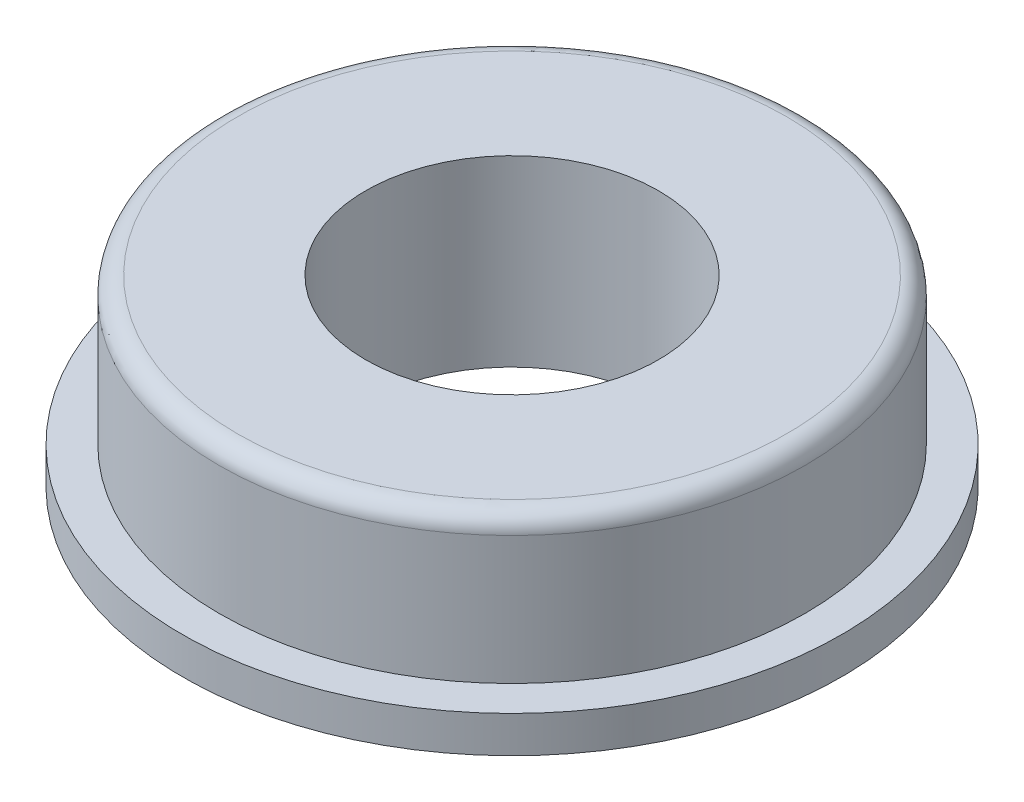
ISO-10303-21;
HEADER;
FILE_DESCRIPTION(('STEP AP214'),'2;1');
FILE_NAME('part.step','',(''),(''),'','','');
FILE_SCHEMA(('AUTOMOTIVE_DESIGN { 1 0 10303 214 1 1 1 1 }'));
ENDSEC;
DATA;
#1=APPLICATION_CONTEXT('core data for automotive mechanical design processes');
#2=APPLICATION_PROTOCOL_DEFINITION('international standard','automotive_design',2000,#1);
#3=PRODUCT_CONTEXT('',#1,'mechanical');
#4=PRODUCT('Part','Part','',(#3));
#5=PRODUCT_RELATED_PRODUCT_CATEGORY('part','',(#4));
#6=PRODUCT_DEFINITION_FORMATION('','',#4);
#7=PRODUCT_DEFINITION_CONTEXT('part definition',#1,'design');
#8=PRODUCT_DEFINITION('design','',#6,#7);
#9=PRODUCT_DEFINITION_SHAPE('','',#8);
#10=(LENGTH_UNIT() NAMED_UNIT(*) SI_UNIT(.MILLI.,.METRE.));
#11=(NAMED_UNIT(*) PLANE_ANGLE_UNIT() SI_UNIT($,.RADIAN.));
#12=(NAMED_UNIT(*) SI_UNIT($,.STERADIAN.) SOLID_ANGLE_UNIT());
#13=UNCERTAINTY_MEASURE_WITH_UNIT(LENGTH_MEASURE(1.E-05),#10,'distance_accuracy_value','');
#14=(GEOMETRIC_REPRESENTATION_CONTEXT(3) GLOBAL_UNCERTAINTY_ASSIGNED_CONTEXT((#13)) GLOBAL_UNIT_ASSIGNED_CONTEXT((#10,
#11,#12)) REPRESENTATION_CONTEXT('',''));
#15=CARTESIAN_POINT('',(0.,0.,0.));
#16=DIRECTION('',(0.,0.,1.));
#17=DIRECTION('',(1.,0.,0.));
#18=AXIS2_PLACEMENT_3D('',#15,#16,#17);
#19=CARTESIAN_POINT('',(0.,4.5,0.));
#20=DIRECTION('',(0.,1.,0.));
#21=DIRECTION('',(0.,0.,1.));
#22=AXIS2_PLACEMENT_3D('',#19,#20,#21);
#23=TOROIDAL_SURFACE('',#22,7.5,0.5);
#24=CARTESIAN_POINT('',(0.,4.5,0.));
#25=DIRECTION('',(0.,-1.,0.));
#26=DIRECTION('',(0.,0.,-1.));
#27=AXIS2_PLACEMENT_3D('',#24,#25,#26);
#28=CIRCLE('',#27,8.);
#29=CARTESIAN_POINT('',(0.,4.5,-8.));
#30=VERTEX_POINT('',#29);
#31=EDGE_CURVE('E46',#30,#30,#28,.T.);
#32=ORIENTED_EDGE('',*,*,#31,.F.);
#33=EDGE_LOOP('',(#32));
#34=FACE_BOUND('',#33,.T.);
#35=CARTESIAN_POINT('',(0.,5.,0.));
#36=DIRECTION('',(0.,-1.,0.));
#37=DIRECTION('',(0.,0.,1.));
#38=AXIS2_PLACEMENT_3D('',#35,#36,#37);
#39=CIRCLE('',#38,7.5);
#40=CARTESIAN_POINT('',(0.,5.,-7.5));
#41=VERTEX_POINT('',#40);
#42=CARTESIAN_POINT('',(0.,5.,7.5));
#43=VERTEX_POINT('',#42);
#44=EDGE_CURVE('E38',#41,#43,#39,.F.);
#45=ORIENTED_EDGE('',*,*,#44,.F.);
#46=CARTESIAN_POINT('',(0.,5.,0.));
#47=DIRECTION('',(0.,-1.,0.));
#48=DIRECTION('',(0.,0.,-1.));
#49=AXIS2_PLACEMENT_3D('',#46,#47,#48);
#50=CIRCLE('',#49,7.5);
#51=EDGE_CURVE('E35',#43,#41,#50,.F.);
#52=ORIENTED_EDGE('',*,*,#51,.F.);
#53=EDGE_LOOP('',(#45,#52));
#54=FACE_BOUND('',#53,.T.);
#55=ADVANCED_FACE('F17',(#34,#54),#23,.T.);
#56=CARTESIAN_POINT('',(0.,5.,0.));
#57=DIRECTION('',(0.,-1.,0.));
#58=DIRECTION('',(0.,0.,-1.));
#59=AXIS2_PLACEMENT_3D('',#56,#57,#58);
#60=CYLINDRICAL_SURFACE('',#59,8.);
#61=CARTESIAN_POINT('',(0.,1.,0.));
#62=DIRECTION('',(0.,-1.,0.));
#63=DIRECTION('',(0.,0.,-1.));
#64=AXIS2_PLACEMENT_3D('',#61,#62,#63);
#65=CIRCLE('',#64,8.);
#66=CARTESIAN_POINT('',(0.,1.,-8.));
#67=VERTEX_POINT('',#66);
#68=EDGE_CURVE('E43',#67,#67,#65,.F.);
#69=ORIENTED_EDGE('',*,*,#68,.T.);
#70=EDGE_LOOP('',(#69));
#71=FACE_BOUND('',#70,.T.);
#72=ORIENTED_EDGE('',*,*,#31,.T.);
#73=EDGE_LOOP('',(#72));
#74=FACE_BOUND('',#73,.T.);
#75=ADVANCED_FACE('F80',(#71,#74),#60,.T.);
#76=CARTESIAN_POINT('',(0.,5.,0.));
#77=DIRECTION('',(0.,1.,0.));
#78=DIRECTION('',(0.,0.,1.));
#79=AXIS2_PLACEMENT_3D('',#76,#77,#78);
#80=PLANE('',#79);
#81=CARTESIAN_POINT('',(0.,5.,0.));
#82=DIRECTION('',(0.,-1.,0.));
#83=DIRECTION('',(0.,0.,-1.));
#84=AXIS2_PLACEMENT_3D('',#81,#82,#83);
#85=CIRCLE('',#84,4.);
#86=CARTESIAN_POINT('',(0.,5.,-4.));
#87=VERTEX_POINT('',#86);
#88=EDGE_CURVE('E50',#87,#87,#85,.T.);
#89=ORIENTED_EDGE('',*,*,#88,.T.);
#90=EDGE_LOOP('',(#89));
#91=FACE_BOUND('',#90,.T.);
#92=ORIENTED_EDGE('',*,*,#51,.T.);
#93=ORIENTED_EDGE('',*,*,#44,.T.);
#94=EDGE_LOOP('',(#92,#93));
#95=FACE_BOUND('',#94,.T.);
#96=ADVANCED_FACE('F40',(#91,#95),#80,.T.);
#97=CARTESIAN_POINT('',(0.,1.,0.));
#98=DIRECTION('',(0.,-1.,0.));
#99=DIRECTION('',(0.,0.,-1.));
#100=AXIS2_PLACEMENT_3D('',#97,#98,#99);
#101=PLANE('',#100);
#102=ORIENTED_EDGE('',*,*,#68,.F.);
#103=EDGE_LOOP('',(#102));
#104=FACE_BOUND('',#103,.T.);
#105=CARTESIAN_POINT('',(0.,1.,0.));
#106=DIRECTION('',(0.,-1.,0.));
#107=DIRECTION('',(0.,0.,-1.));
#108=AXIS2_PLACEMENT_3D('',#105,#106,#107);
#109=CIRCLE('',#108,9.);
#110=CARTESIAN_POINT('',(0.,1.,-9.));
#111=VERTEX_POINT('',#110);
#112=EDGE_CURVE('E53',#111,#111,#109,.T.);
#113=ORIENTED_EDGE('',*,*,#112,.F.);
#114=EDGE_LOOP('',(#113));
#115=FACE_BOUND('',#114,.T.);
#116=ADVANCED_FACE('F79',(#104,#115),#101,.F.);
#117=CARTESIAN_POINT('',(0.,5.,0.));
#118=DIRECTION('',(0.,-1.,0.));
#119=DIRECTION('',(0.,0.,-1.));
#120=AXIS2_PLACEMENT_3D('',#117,#118,#119);
#121=CYLINDRICAL_SURFACE('',#120,4.);
#122=CARTESIAN_POINT('',(0.,0.,0.));
#123=DIRECTION('',(0.,-1.,0.));
#124=DIRECTION('',(0.,0.,-1.));
#125=AXIS2_PLACEMENT_3D('',#122,#123,#124);
#126=CIRCLE('',#125,4.);
#127=CARTESIAN_POINT('',(0.,0.,-4.));
#128=VERTEX_POINT('',#127);
#129=EDGE_CURVE('E28',#128,#128,#126,.T.);
#130=ORIENTED_EDGE('',*,*,#129,.T.);
#131=EDGE_LOOP('',(#130));
#132=FACE_BOUND('',#131,.T.);
#133=ORIENTED_EDGE('',*,*,#88,.F.);
#134=EDGE_LOOP('',(#133));
#135=FACE_BOUND('',#134,.T.);
#136=ADVANCED_FACE('F107',(#132,#135),#121,.F.);
#137=CARTESIAN_POINT('',(0.,1.,0.));
#138=DIRECTION('',(0.,-1.,0.));
#139=DIRECTION('',(0.,0.,-1.));
#140=AXIS2_PLACEMENT_3D('',#137,#138,#139);
#141=CYLINDRICAL_SURFACE('',#140,9.);
#142=CARTESIAN_POINT('',(0.,0.,0.));
#143=DIRECTION('',(0.,-1.,0.));
#144=DIRECTION('',(0.,0.,-1.));
#145=AXIS2_PLACEMENT_3D('',#142,#143,#144);
#146=CIRCLE('',#145,9.);
#147=CARTESIAN_POINT('',(0.,0.,-9.));
#148=VERTEX_POINT('',#147);
#149=EDGE_CURVE('E11',#148,#148,#146,.F.);
#150=ORIENTED_EDGE('',*,*,#149,.T.);
#151=EDGE_LOOP('',(#150));
#152=FACE_BOUND('',#151,.T.);
#153=ORIENTED_EDGE('',*,*,#112,.T.);
#154=EDGE_LOOP('',(#153));
#155=FACE_BOUND('',#154,.T.);
#156=ADVANCED_FACE('F101',(#152,#155),#141,.T.);
#157=CARTESIAN_POINT('',(0.,0.,0.));
#158=DIRECTION('',(0.,1.,0.));
#159=DIRECTION('',(0.,0.,1.));
#160=AXIS2_PLACEMENT_3D('',#157,#158,#159);
#161=PLANE('',#160);
#162=ORIENTED_EDGE('',*,*,#149,.F.);
#163=EDGE_LOOP('',(#162));
#164=FACE_BOUND('',#163,.T.);
#165=ORIENTED_EDGE('',*,*,#129,.F.);
#166=EDGE_LOOP('',(#165));
#167=FACE_BOUND('',#166,.T.);
#168=ADVANCED_FACE('F99',(#164,#167),#161,.F.);
#169=CLOSED_SHELL('',(#55,#75,#96,#116,#136,#156,#168));
#170=MANIFOLD_SOLID_BREP('B1',#169);
#171=ADVANCED_BREP_SHAPE_REPRESENTATION('',(#18,#170),#14);
#172=SHAPE_DEFINITION_REPRESENTATION(#9,#171);
ENDSEC;
END-ISO-10303-21;
